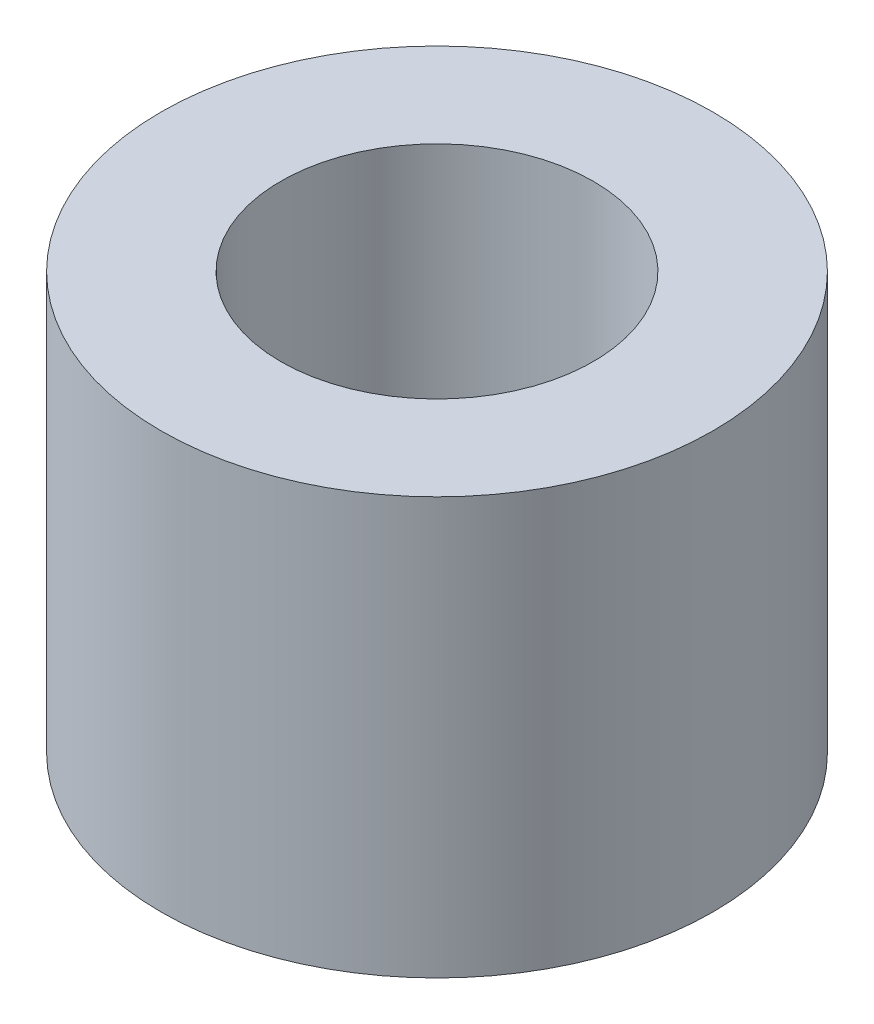
ISO-10303-21;
HEADER;
FILE_DESCRIPTION(('STEP AP214'),'2;1');
FILE_NAME('part.step','',(''),(''),'','','');
FILE_SCHEMA(('AUTOMOTIVE_DESIGN { 1 0 10303 214 1 1 1 1 }'));
ENDSEC;
DATA;
#1=APPLICATION_CONTEXT('core data for automotive mechanical design processes');
#2=APPLICATION_PROTOCOL_DEFINITION('international standard','automotive_design',2000,#1);
#3=PRODUCT_CONTEXT('',#1,'mechanical');
#4=PRODUCT('Part','Part','',(#3));
#5=PRODUCT_RELATED_PRODUCT_CATEGORY('part','',(#4));
#6=PRODUCT_DEFINITION_FORMATION('','',#4);
#7=PRODUCT_DEFINITION_CONTEXT('part definition',#1,'design');
#8=PRODUCT_DEFINITION('design','',#6,#7);
#9=PRODUCT_DEFINITION_SHAPE('','',#8);
#10=(LENGTH_UNIT() NAMED_UNIT(*) SI_UNIT(.MILLI.,.METRE.));
#11=(NAMED_UNIT(*) PLANE_ANGLE_UNIT() SI_UNIT($,.RADIAN.));
#12=(NAMED_UNIT(*) SI_UNIT($,.STERADIAN.) SOLID_ANGLE_UNIT());
#13=UNCERTAINTY_MEASURE_WITH_UNIT(LENGTH_MEASURE(1.E-05),#10,'distance_accuracy_value','');
#14=(GEOMETRIC_REPRESENTATION_CONTEXT(3) GLOBAL_UNCERTAINTY_ASSIGNED_CONTEXT((#13)) GLOBAL_UNIT_ASSIGNED_CONTEXT((#10,
#11,#12)) REPRESENTATION_CONTEXT('',''));
#15=CARTESIAN_POINT('',(0.,0.,0.));
#16=DIRECTION('',(0.,0.,1.));
#17=DIRECTION('',(1.,0.,0.));
#18=AXIS2_PLACEMENT_3D('',#15,#16,#17);
#19=CARTESIAN_POINT('',(0.,3.,0.));
#20=DIRECTION('',(0.,-1.,0.));
#21=DIRECTION('',(0.,0.,-1.));
#22=AXIS2_PLACEMENT_3D('',#19,#20,#21);
#23=CYLINDRICAL_SURFACE('',#22,3.9751);
#24=CARTESIAN_POINT('',(0.,3.,0.));
#25=DIRECTION('',(0.,1.,0.));
#26=DIRECTION('',(0.,0.,1.));
#27=AXIS2_PLACEMENT_3D('',#24,#25,#26);
#28=CIRCLE('',#27,3.9751);
#29=CARTESIAN_POINT('',(0.,3.,3.9751));
#30=VERTEX_POINT('',#29);
#31=EDGE_CURVE('E10',#30,#30,#28,.T.);
#32=ORIENTED_EDGE('',*,*,#31,.F.);
#33=EDGE_LOOP('',(#32));
#34=FACE_BOUND('',#33,.T.);
#35=CARTESIAN_POINT('',(0.,-3.,0.));
#36=DIRECTION('',(0.,1.,0.));
#37=DIRECTION('',(0.,0.,1.));
#38=AXIS2_PLACEMENT_3D('',#35,#36,#37);
#39=CIRCLE('',#38,3.9751);
#40=CARTESIAN_POINT('',(0.,-3.,3.9751));
#41=VERTEX_POINT('',#40);
#42=EDGE_CURVE('E42',#41,#41,#39,.T.);
#43=ORIENTED_EDGE('',*,*,#42,.T.);
#44=EDGE_LOOP('',(#43));
#45=FACE_BOUND('',#44,.T.);
#46=ADVANCED_FACE('F39',(#34,#45),#23,.T.);
#47=CARTESIAN_POINT('',(0.,3.,0.));
#48=DIRECTION('',(0.,1.,0.));
#49=DIRECTION('',(0.,0.,1.));
#50=AXIS2_PLACEMENT_3D('',#47,#48,#49);
#51=PLANE('',#50);
#52=CARTESIAN_POINT('',(0.,3.,0.));
#53=DIRECTION('',(0.,1.,0.));
#54=DIRECTION('',(0.,0.,1.));
#55=AXIS2_PLACEMENT_3D('',#52,#53,#54);
#56=CIRCLE('',#55,2.24999999999999);
#57=CARTESIAN_POINT('',(0.,3.,2.24999999999999));
#58=VERTEX_POINT('',#57);
#59=EDGE_CURVE('E53',#58,#58,#56,.T.);
#60=ORIENTED_EDGE('',*,*,#59,.F.);
#61=EDGE_LOOP('',(#60));
#62=FACE_BOUND('',#61,.T.);
#63=ORIENTED_EDGE('',*,*,#31,.T.);
#64=EDGE_LOOP('',(#63));
#65=FACE_BOUND('',#64,.T.);
#66=ADVANCED_FACE('F59',(#62,#65),#51,.T.);
#67=CARTESIAN_POINT('',(0.,-3.,0.));
#68=DIRECTION('',(0.,1.,0.));
#69=DIRECTION('',(0.,0.,1.));
#70=AXIS2_PLACEMENT_3D('',#67,#68,#69);
#71=PLANE('',#70);
#72=CARTESIAN_POINT('',(0.,-3.,0.));
#73=DIRECTION('',(0.,1.,0.));
#74=DIRECTION('',(0.,0.,1.));
#75=AXIS2_PLACEMENT_3D('',#72,#73,#74);
#76=CIRCLE('',#75,2.25);
#77=CARTESIAN_POINT('',(0.,-3.,2.25));
#78=VERTEX_POINT('',#77);
#79=EDGE_CURVE('E49',#78,#78,#76,.T.);
#80=ORIENTED_EDGE('',*,*,#79,.T.);
#81=EDGE_LOOP('',(#80));
#82=FACE_BOUND('',#81,.T.);
#83=ORIENTED_EDGE('',*,*,#42,.F.);
#84=EDGE_LOOP('',(#83));
#85=FACE_BOUND('',#84,.T.);
#86=ADVANCED_FACE('F61',(#82,#85),#71,.F.);
#87=CARTESIAN_POINT('',(0.,3.,0.));
#88=DIRECTION('',(0.,1.,0.));
#89=DIRECTION('',(0.,0.,1.));
#90=AXIS2_PLACEMENT_3D('',#87,#88,#89);
#91=CYLINDRICAL_SURFACE('',#90,2.24999999999999);
#92=ORIENTED_EDGE('',*,*,#79,.F.);
#93=EDGE_LOOP('',(#92));
#94=FACE_BOUND('',#93,.T.);
#95=ORIENTED_EDGE('',*,*,#59,.T.);
#96=EDGE_LOOP('',(#95));
#97=FACE_BOUND('',#96,.T.);
#98=ADVANCED_FACE('F57',(#94,#97),#91,.F.);
#99=CLOSED_SHELL('',(#46,#66,#86,#98));
#100=MANIFOLD_SOLID_BREP('B2',#99);
#101=ADVANCED_BREP_SHAPE_REPRESENTATION('',(#18,#100),#14);
#102=SHAPE_DEFINITION_REPRESENTATION(#9,#101);
ENDSEC;
END-ISO-10303-21;
